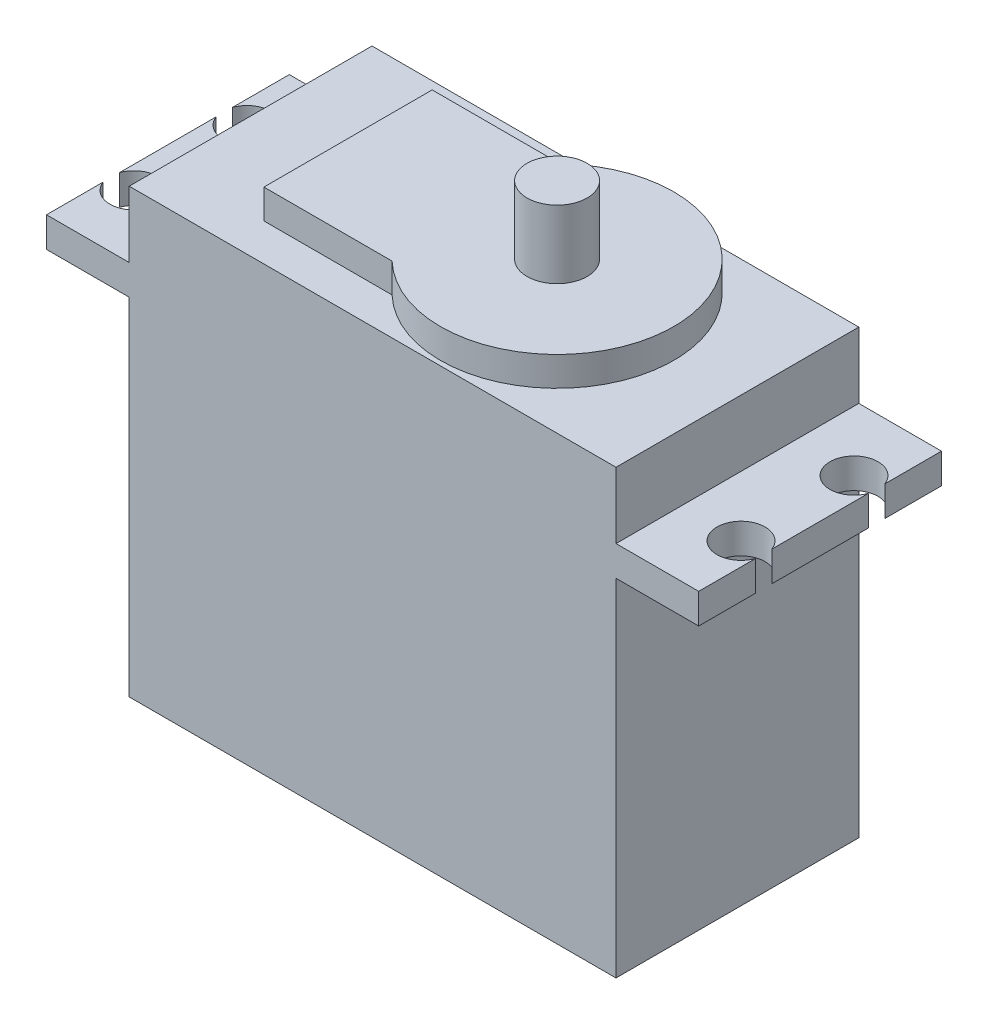
ISO-10303-21;
HEADER;
FILE_DESCRIPTION(('STEP AP214'),'2;1');
FILE_NAME('part.step','',(''),(''),'','','');
FILE_SCHEMA(('AUTOMOTIVE_DESIGN { 1 0 10303 214 1 1 1 1 }'));
ENDSEC;
DATA;
#1=APPLICATION_CONTEXT('core data for automotive mechanical design processes');
#2=APPLICATION_PROTOCOL_DEFINITION('international standard','automotive_design',2000,#1);
#3=PRODUCT_CONTEXT('',#1,'mechanical');
#4=PRODUCT('Part','Part','',(#3));
#5=PRODUCT_RELATED_PRODUCT_CATEGORY('part','',(#4));
#6=PRODUCT_DEFINITION_FORMATION('','',#4);
#7=PRODUCT_DEFINITION_CONTEXT('part definition',#1,'design');
#8=PRODUCT_DEFINITION('design','',#6,#7);
#9=PRODUCT_DEFINITION_SHAPE('','',#8);
#10=(LENGTH_UNIT() NAMED_UNIT(*) SI_UNIT(.MILLI.,.METRE.));
#11=(NAMED_UNIT(*) PLANE_ANGLE_UNIT() SI_UNIT($,.RADIAN.));
#12=(NAMED_UNIT(*) SI_UNIT($,.STERADIAN.) SOLID_ANGLE_UNIT());
#13=UNCERTAINTY_MEASURE_WITH_UNIT(LENGTH_MEASURE(1.E-05),#10,'distance_accuracy_value','');
#14=(GEOMETRIC_REPRESENTATION_CONTEXT(3) GLOBAL_UNCERTAINTY_ASSIGNED_CONTEXT((#13)) GLOBAL_UNIT_ASSIGNED_CONTEXT((#10,
#11,#12)) REPRESENTATION_CONTEXT('',''));
#15=CARTESIAN_POINT('',(0.,0.,0.));
#16=DIRECTION('',(0.,0.,1.));
#17=DIRECTION('',(1.,0.,0.));
#18=AXIS2_PLACEMENT_3D('',#15,#16,#17);
#19=CARTESIAN_POINT('',(-6.88,0.,0.));
#20=DIRECTION('',(-1.,0.,0.));
#21=DIRECTION('',(0.,0.,1.));
#22=AXIS2_PLACEMENT_3D('',#19,#20,#21);
#23=PLANE('',#22);
#24=DIRECTION('',(0.,1.,0.));
#25=VECTOR('',#24,1.);
#26=CARTESIAN_POINT('',(-6.88000000000001,0.,-14.1176511156307));
#27=LINE('',#26,#25);
#28=CARTESIAN_POINT('',(-6.88000000000001,28.8,-14.1176511156307));
#29=VERTEX_POINT('',#28);
#30=CARTESIAN_POINT('',(-6.88000000000001,31.3,-14.1176511156307));
#31=VERTEX_POINT('',#30);
#32=EDGE_CURVE('E11',#29,#31,#27,.T.);
#33=ORIENTED_EDGE('',*,*,#32,.F.);
#34=DIRECTION('',(0.,0.,1.));
#35=VECTOR('',#34,1.);
#36=CARTESIAN_POINT('',(-6.88000000000001,28.8,-20.2));
#37=LINE('',#36,#35);
#38=CARTESIAN_POINT('',(-6.88000000000001,28.8,-6.08234888436929));
#39=VERTEX_POINT('',#38);
#40=EDGE_CURVE('E329',#29,#39,#37,.T.);
#41=ORIENTED_EDGE('',*,*,#40,.T.);
#42=DIRECTION('',(0.,1.,0.));
#43=VECTOR('',#42,1.);
#44=CARTESIAN_POINT('',(-6.88000000000001,0.,-6.08234888436929));
#45=LINE('',#44,#43);
#46=CARTESIAN_POINT('',(-6.88,31.3,-6.08234888436929));
#47=VERTEX_POINT('',#46);
#48=EDGE_CURVE('E214',#47,#39,#45,.F.);
#49=ORIENTED_EDGE('',*,*,#48,.F.);
#50=DIRECTION('',(0.,0.,-1.));
#51=VECTOR('',#50,1.);
#52=CARTESIAN_POINT('',(-6.88000000000001,31.3,-20.2));
#53=LINE('',#52,#51);
#54=EDGE_CURVE('E209',#47,#31,#53,.T.);
#55=ORIENTED_EDGE('',*,*,#54,.T.);
#56=EDGE_LOOP('',(#33,#41,#49,#55));
#57=FACE_BOUND('',#56,.T.);
#58=ADVANCED_FACE('F40',(#57),#23,.T.);
#59=DIRECTION('',(0.,1.,0.));
#60=VECTOR('',#59,1.);
#61=CARTESIAN_POINT('',(-6.88,0.,-4.71765111563071));
#62=LINE('',#61,#60);
#63=CARTESIAN_POINT('',(-6.88,28.8,-4.71765111563071));
#64=VERTEX_POINT('',#63);
#65=CARTESIAN_POINT('',(-6.88,31.3,-4.71765111563071));
#66=VERTEX_POINT('',#65);
#67=EDGE_CURVE('E321',#64,#66,#62,.T.);
#68=ORIENTED_EDGE('',*,*,#67,.F.);
#69=CARTESIAN_POINT('',(-6.88,28.8,0.));
#70=VERTEX_POINT('',#69);
#71=EDGE_CURVE('E336',#64,#70,#37,.T.);
#72=ORIENTED_EDGE('',*,*,#71,.T.);
#73=DIRECTION('',(0.,1.,0.));
#74=VECTOR('',#73,1.);
#75=CARTESIAN_POINT('',(-6.88,31.3,0.));
#76=LINE('',#75,#74);
#77=CARTESIAN_POINT('',(-6.88,31.3,0.));
#78=VERTEX_POINT('',#77);
#79=EDGE_CURVE('E219',#70,#78,#76,.T.);
#80=ORIENTED_EDGE('',*,*,#79,.T.);
#81=EDGE_CURVE('E215',#78,#66,#53,.T.);
#82=ORIENTED_EDGE('',*,*,#81,.T.);
#83=EDGE_LOOP('',(#68,#72,#80,#82));
#84=FACE_BOUND('',#83,.T.);
#85=ADVANCED_FACE('F426',(#84),#23,.T.);
#86=CARTESIAN_POINT('',(47.38,0.,0.));
#87=DIRECTION('',(1.,0.,0.));
#88=DIRECTION('',(0.,0.,-1.));
#89=AXIS2_PLACEMENT_3D('',#86,#87,#88);
#90=PLANE('',#89);
#91=DIRECTION('',(0.,1.,0.));
#92=VECTOR('',#91,1.);
#93=CARTESIAN_POINT('',(47.38,0.,-6.08234888436926));
#94=LINE('',#93,#92);
#95=CARTESIAN_POINT('',(47.38,28.8,-6.08234888436925));
#96=VERTEX_POINT('',#95);
#97=CARTESIAN_POINT('',(47.38,31.3,-6.08234888436925));
#98=VERTEX_POINT('',#97);
#99=EDGE_CURVE('E318',#96,#98,#94,.T.);
#100=ORIENTED_EDGE('',*,*,#99,.F.);
#101=DIRECTION('',(0.,0.,-1.));
#102=VECTOR('',#101,1.);
#103=CARTESIAN_POINT('',(47.38,28.8,0.));
#104=LINE('',#103,#102);
#105=CARTESIAN_POINT('',(47.38,28.8,-14.1176511156307));
#106=VERTEX_POINT('',#105);
#107=EDGE_CURVE('E370',#96,#106,#104,.T.);
#108=ORIENTED_EDGE('',*,*,#107,.T.);
#109=DIRECTION('',(0.,1.,0.));
#110=VECTOR('',#109,1.);
#111=CARTESIAN_POINT('',(47.38,0.,-14.1176511156307));
#112=LINE('',#111,#110);
#113=CARTESIAN_POINT('',(47.38,31.3,-14.1176511156307));
#114=VERTEX_POINT('',#113);
#115=EDGE_CURVE('E249',#114,#106,#112,.F.);
#116=ORIENTED_EDGE('',*,*,#115,.F.);
#117=DIRECTION('',(0.,0.,1.));
#118=VECTOR('',#117,1.);
#119=CARTESIAN_POINT('',(47.38,31.3,0.));
#120=LINE('',#119,#118);
#121=EDGE_CURVE('E363',#114,#98,#120,.T.);
#122=ORIENTED_EDGE('',*,*,#121,.T.);
#123=EDGE_LOOP('',(#100,#108,#116,#122));
#124=FACE_BOUND('',#123,.T.);
#125=ADVANCED_FACE('F396',(#124),#90,.T.);
#126=DIRECTION('',(0.,1.,0.));
#127=VECTOR('',#126,1.);
#128=CARTESIAN_POINT('',(47.38,0.,-15.4823488843693));
#129=LINE('',#128,#127);
#130=CARTESIAN_POINT('',(47.38,28.8,-15.4823488843693));
#131=VERTEX_POINT('',#130);
#132=CARTESIAN_POINT('',(47.38,31.3,-15.4823488843693));
#133=VERTEX_POINT('',#132);
#134=EDGE_CURVE('E314',#131,#133,#129,.T.);
#135=ORIENTED_EDGE('',*,*,#134,.F.);
#136=CARTESIAN_POINT('',(47.38,28.8,-20.2));
#137=VERTEX_POINT('',#136);
#138=EDGE_CURVE('E371',#131,#137,#104,.T.);
#139=ORIENTED_EDGE('',*,*,#138,.T.);
#140=DIRECTION('',(0.,1.,0.));
#141=VECTOR('',#140,1.);
#142=CARTESIAN_POINT('',(47.38,31.3,-20.2));
#143=LINE('',#142,#141);
#144=CARTESIAN_POINT('',(47.38,31.3,-20.2));
#145=VERTEX_POINT('',#144);
#146=EDGE_CURVE('E365',#137,#145,#143,.T.);
#147=ORIENTED_EDGE('',*,*,#146,.T.);
#148=EDGE_CURVE('E354',#145,#133,#120,.T.);
#149=ORIENTED_EDGE('',*,*,#148,.T.);
#150=EDGE_LOOP('',(#135,#139,#147,#149));
#151=FACE_BOUND('',#150,.T.);
#152=ADVANCED_FACE('F487',(#151),#90,.T.);
#153=CARTESIAN_POINT('',(40.5,36.8,0.));
#154=DIRECTION('',(-1.,0.,0.));
#155=DIRECTION('',(0.,0.,1.));
#156=AXIS2_PLACEMENT_3D('',#153,#154,#155);
#157=PLANE('',#156);
#158=DIRECTION('',(0.,0.,1.));
#159=VECTOR('',#158,1.);
#160=CARTESIAN_POINT('',(40.5,31.3,0.));
#161=LINE('',#160,#159);
#162=CARTESIAN_POINT('',(40.5,31.3,-20.2));
#163=VERTEX_POINT('',#162);
#164=CARTESIAN_POINT('',(40.5,31.3,0.));
#165=VERTEX_POINT('',#164);
#166=EDGE_CURVE('E355',#163,#165,#161,.T.);
#167=ORIENTED_EDGE('',*,*,#166,.F.);
#168=DIRECTION('',(0.,-1.,0.));
#169=VECTOR('',#168,1.);
#170=CARTESIAN_POINT('',(40.5,36.8,-20.2));
#171=LINE('',#170,#169);
#172=CARTESIAN_POINT('',(40.5,36.8,-20.2));
#173=VERTEX_POINT('',#172);
#174=EDGE_CURVE('E304',#173,#163,#171,.T.);
#175=ORIENTED_EDGE('',*,*,#174,.F.);
#176=DIRECTION('',(0.,0.,-1.));
#177=VECTOR('',#176,1.);
#178=CARTESIAN_POINT('',(40.5,36.8,0.));
#179=LINE('',#178,#177);
#180=CARTESIAN_POINT('',(40.5,36.8,0.));
#181=VERTEX_POINT('',#180);
#182=EDGE_CURVE('E286',#181,#173,#179,.T.);
#183=ORIENTED_EDGE('',*,*,#182,.F.);
#184=DIRECTION('',(0.,-1.,0.));
#185=VECTOR('',#184,1.);
#186=CARTESIAN_POINT('',(40.5,36.8,0.));
#187=LINE('',#186,#185);
#188=EDGE_CURVE('E308',#181,#165,#187,.T.);
#189=ORIENTED_EDGE('',*,*,#188,.T.);
#190=EDGE_LOOP('',(#167,#175,#183,#189));
#191=FACE_BOUND('',#190,.T.);
#192=ADVANCED_FACE('F484',(#191),#157,.F.);
#193=DIRECTION('',(0.,0.,-1.));
#194=VECTOR('',#193,1.);
#195=CARTESIAN_POINT('',(40.5,28.8,0.));
#196=LINE('',#195,#194);
#197=CARTESIAN_POINT('',(40.5,28.8,0.));
#198=VERTEX_POINT('',#197);
#199=CARTESIAN_POINT('',(40.5,28.8,-20.2));
#200=VERTEX_POINT('',#199);
#201=EDGE_CURVE('E330',#198,#200,#196,.T.);
#202=ORIENTED_EDGE('',*,*,#201,.F.);
#203=CARTESIAN_POINT('',(40.5,0.,0.));
#204=VERTEX_POINT('',#203);
#205=EDGE_CURVE('E307',#198,#204,#187,.T.);
#206=ORIENTED_EDGE('',*,*,#205,.T.);
#207=DIRECTION('',(0.,0.,-1.));
#208=VECTOR('',#207,1.);
#209=CARTESIAN_POINT('',(40.5,0.,0.));
#210=LINE('',#209,#208);
#211=CARTESIAN_POINT('',(40.5,0.,-20.2));
#212=VERTEX_POINT('',#211);
#213=EDGE_CURVE('E296',#204,#212,#210,.T.);
#214=ORIENTED_EDGE('',*,*,#213,.T.);
#215=EDGE_CURVE('E303',#200,#212,#171,.T.);
#216=ORIENTED_EDGE('',*,*,#215,.F.);
#217=EDGE_LOOP('',(#202,#206,#214,#216));
#218=FACE_BOUND('',#217,.T.);
#219=ADVANCED_FACE('F486',(#218),#157,.F.);
#220=CARTESIAN_POINT('',(0.,36.8,0.));
#221=DIRECTION('',(1.,0.,0.));
#222=DIRECTION('',(0.,0.,-1.));
#223=AXIS2_PLACEMENT_3D('',#220,#221,#222);
#224=PLANE('',#223);
#225=DIRECTION('',(0.,0.,-1.));
#226=VECTOR('',#225,1.);
#227=CARTESIAN_POINT('',(0.,31.3,-20.2));
#228=LINE('',#227,#226);
#229=CARTESIAN_POINT('',(0.,31.3,0.));
#230=VERTEX_POINT('',#229);
#231=CARTESIAN_POINT('',(0.,31.3,-20.2));
#232=VERTEX_POINT('',#231);
#233=EDGE_CURVE('E226',#230,#232,#228,.T.);
#234=ORIENTED_EDGE('',*,*,#233,.F.);
#235=DIRECTION('',(0.,-1.,0.));
#236=VECTOR('',#235,1.);
#237=CARTESIAN_POINT('',(0.,36.8,0.));
#238=LINE('',#237,#236);
#239=CARTESIAN_POINT('',(0.,36.8,0.));
#240=VERTEX_POINT('',#239);
#241=EDGE_CURVE('E250',#240,#230,#238,.T.);
#242=ORIENTED_EDGE('',*,*,#241,.F.);
#243=DIRECTION('',(0.,0.,1.));
#244=VECTOR('',#243,1.);
#245=CARTESIAN_POINT('',(0.,36.8,0.));
#246=LINE('',#245,#244);
#247=CARTESIAN_POINT('',(0.,36.8,-20.2));
#248=VERTEX_POINT('',#247);
#249=EDGE_CURVE('E280',#248,#240,#246,.T.);
#250=ORIENTED_EDGE('',*,*,#249,.F.);
#251=DIRECTION('',(0.,-1.,0.));
#252=VECTOR('',#251,1.);
#253=CARTESIAN_POINT('',(0.,36.8,-20.2));
#254=LINE('',#253,#252);
#255=EDGE_CURVE('E301',#248,#232,#254,.T.);
#256=ORIENTED_EDGE('',*,*,#255,.T.);
#257=EDGE_LOOP('',(#234,#242,#250,#256));
#258=FACE_BOUND('',#257,.T.);
#259=ADVANCED_FACE('F42',(#258),#224,.F.);
#260=DIRECTION('',(0.,0.,1.));
#261=VECTOR('',#260,1.);
#262=CARTESIAN_POINT('',(0.,28.8,-20.2));
#263=LINE('',#262,#261);
#264=CARTESIAN_POINT('',(0.,28.8,-20.2));
#265=VERTEX_POINT('',#264);
#266=CARTESIAN_POINT('',(0.,28.8,0.));
#267=VERTEX_POINT('',#266);
#268=EDGE_CURVE('E223',#265,#267,#263,.T.);
#269=ORIENTED_EDGE('',*,*,#268,.F.);
#270=CARTESIAN_POINT('',(0.,0.,-20.2));
#271=VERTEX_POINT('',#270);
#272=EDGE_CURVE('E290',#265,#271,#254,.T.);
#273=ORIENTED_EDGE('',*,*,#272,.T.);
#274=DIRECTION('',(0.,0.,1.));
#275=VECTOR('',#274,1.);
#276=CARTESIAN_POINT('',(0.,0.,0.));
#277=LINE('',#276,#275);
#278=CARTESIAN_POINT('',(0.,0.,0.));
#279=VERTEX_POINT('',#278);
#280=EDGE_CURVE('E279',#271,#279,#277,.T.);
#281=ORIENTED_EDGE('',*,*,#280,.T.);
#282=EDGE_CURVE('E310',#267,#279,#238,.T.);
#283=ORIENTED_EDGE('',*,*,#282,.F.);
#284=EDGE_LOOP('',(#269,#273,#281,#283));
#285=FACE_BOUND('',#284,.T.);
#286=ADVANCED_FACE('F475',(#285),#224,.F.);
#287=CARTESIAN_POINT('',(0.,36.8,0.));
#288=DIRECTION('',(0.,-1.,0.));
#289=DIRECTION('',(0.,0.,-1.));
#290=AXIS2_PLACEMENT_3D('',#287,#288,#289);
#291=PLANE('',#290);
#292=ORIENTED_EDGE('',*,*,#249,.T.);
#293=DIRECTION('',(1.,0.,0.));
#294=VECTOR('',#293,1.);
#295=CARTESIAN_POINT('',(0.,36.8,0.));
#296=LINE('',#295,#294);
#297=EDGE_CURVE('E283',#240,#181,#296,.T.);
#298=ORIENTED_EDGE('',*,*,#297,.T.);
#299=ORIENTED_EDGE('',*,*,#182,.T.);
#300=DIRECTION('',(-1.,0.,0.));
#301=VECTOR('',#300,1.);
#302=CARTESIAN_POINT('',(0.,36.8,-20.2));
#303=LINE('',#302,#301);
#304=EDGE_CURVE('E288',#173,#248,#303,.T.);
#305=ORIENTED_EDGE('',*,*,#304,.T.);
#306=EDGE_LOOP('',(#292,#298,#299,#305));
#307=FACE_BOUND('',#306,.T.);
#308=CARTESIAN_POINT('',(25.5,36.8,-10.1));
#309=DIRECTION('',(0.,1.,0.));
#310=DIRECTION('',(0.,0.,1.));
#311=AXIS2_PLACEMENT_3D('',#308,#309,#310);
#312=CIRCLE('',#311,9.71033311812395);
#313=CARTESIAN_POINT('',(18.7701731623366,36.8,-3.1));
#314=VERTEX_POINT('',#313);
#315=CARTESIAN_POINT('',(18.7701731623366,36.8,-17.1));
#316=VERTEX_POINT('',#315);
#317=EDGE_CURVE('E245',#314,#316,#312,.T.);
#318=ORIENTED_EDGE('',*,*,#317,.F.);
#319=DIRECTION('',(1.,0.,0.));
#320=VECTOR('',#319,1.);
#321=CARTESIAN_POINT('',(0.,36.8,-3.1));
#322=LINE('',#321,#320);
#323=CARTESIAN_POINT('',(8.10646917607981,36.8,-3.1));
#324=VERTEX_POINT('',#323);
#325=EDGE_CURVE('E254',#324,#314,#322,.T.);
#326=ORIENTED_EDGE('',*,*,#325,.F.);
#327=DIRECTION('',(0.,0.,1.));
#328=VECTOR('',#327,1.);
#329=CARTESIAN_POINT('',(8.10646917607981,36.8,0.));
#330=LINE('',#329,#328);
#331=CARTESIAN_POINT('',(8.10646917607981,36.8,-17.1));
#332=VERTEX_POINT('',#331);
#333=EDGE_CURVE('E266',#332,#324,#330,.T.);
#334=ORIENTED_EDGE('',*,*,#333,.F.);
#335=DIRECTION('',(1.,0.,0.));
#336=VECTOR('',#335,1.);
#337=CARTESIAN_POINT('',(0.,36.8,-17.1));
#338=LINE('',#337,#336);
#339=EDGE_CURVE('E263',#332,#316,#338,.T.);
#340=ORIENTED_EDGE('',*,*,#339,.T.);
#341=EDGE_LOOP('',(#318,#326,#334,#340));
#342=FACE_BOUND('',#341,.T.);
#343=ADVANCED_FACE('F472',(#307,#342),#291,.F.);
#344=CARTESIAN_POINT('',(0.,36.8,0.));
#345=DIRECTION('',(0.,0.,-1.));
#346=DIRECTION('',(-1.,0.,0.));
#347=AXIS2_PLACEMENT_3D('',#344,#345,#346);
#348=PLANE('',#347);
#349=DIRECTION('',(1.,0.,0.));
#350=VECTOR('',#349,1.);
#351=CARTESIAN_POINT('',(0.,0.,0.));
#352=LINE('',#351,#350);
#353=EDGE_CURVE('E293',#279,#204,#352,.T.);
#354=ORIENTED_EDGE('',*,*,#353,.T.);
#355=ORIENTED_EDGE('',*,*,#205,.F.);
#356=DIRECTION('',(-1.,0.,0.));
#357=VECTOR('',#356,1.);
#358=CARTESIAN_POINT('',(47.38,28.8,0.));
#359=LINE('',#358,#357);
#360=CARTESIAN_POINT('',(47.38,28.8,0.));
#361=VERTEX_POINT('',#360);
#362=EDGE_CURVE('E227',#361,#198,#359,.T.);
#363=ORIENTED_EDGE('',*,*,#362,.F.);
#364=DIRECTION('',(0.,-1.,0.));
#365=VECTOR('',#364,1.);
#366=CARTESIAN_POINT('',(47.38,31.3,0.));
#367=LINE('',#366,#365);
#368=CARTESIAN_POINT('',(47.38,31.3,0.));
#369=VERTEX_POINT('',#368);
#370=EDGE_CURVE('E358',#369,#361,#367,.T.);
#371=ORIENTED_EDGE('',*,*,#370,.F.);
#372=DIRECTION('',(-1.,0.,0.));
#373=VECTOR('',#372,1.);
#374=CARTESIAN_POINT('',(47.38,31.3,0.));
#375=LINE('',#374,#373);
#376=EDGE_CURVE('E351',#369,#165,#375,.T.);
#377=ORIENTED_EDGE('',*,*,#376,.T.);
#378=ORIENTED_EDGE('',*,*,#188,.F.);
#379=ORIENTED_EDGE('',*,*,#297,.F.);
#380=ORIENTED_EDGE('',*,*,#241,.T.);
#381=DIRECTION('',(1.,0.,0.));
#382=VECTOR('',#381,1.);
#383=CARTESIAN_POINT('',(-6.88,31.3,0.));
#384=LINE('',#383,#382);
#385=EDGE_CURVE('E233',#78,#230,#384,.T.);
#386=ORIENTED_EDGE('',*,*,#385,.F.);
#387=ORIENTED_EDGE('',*,*,#79,.F.);
#388=DIRECTION('',(1.,0.,0.));
#389=VECTOR('',#388,1.);
#390=CARTESIAN_POINT('',(-6.88,28.8,0.));
#391=LINE('',#390,#389);
#392=EDGE_CURVE('E236',#70,#267,#391,.T.);
#393=ORIENTED_EDGE('',*,*,#392,.T.);
#394=ORIENTED_EDGE('',*,*,#282,.T.);
#395=EDGE_LOOP('',(#354,#355,#363,#371,#377,#378,#379,#380,#386,#387,#393,#394));
#396=FACE_BOUND('',#395,.T.);
#397=ADVANCED_FACE('F409',(#396),#348,.F.);
#398=CARTESIAN_POINT('',(0.,36.8,-20.2));
#399=DIRECTION('',(0.,0.,1.));
#400=DIRECTION('',(1.,0.,0.));
#401=AXIS2_PLACEMENT_3D('',#398,#399,#400);
#402=PLANE('',#401);
#403=DIRECTION('',(-1.,0.,0.));
#404=VECTOR('',#403,1.);
#405=CARTESIAN_POINT('',(0.,0.,-20.2));
#406=LINE('',#405,#404);
#407=EDGE_CURVE('E284',#212,#271,#406,.T.);
#408=ORIENTED_EDGE('',*,*,#407,.T.);
#409=ORIENTED_EDGE('',*,*,#272,.F.);
#410=DIRECTION('',(1.,0.,0.));
#411=VECTOR('',#410,1.);
#412=CARTESIAN_POINT('',(-6.88000000000001,28.8,-20.2));
#413=LINE('',#412,#411);
#414=CARTESIAN_POINT('',(-6.88000000000001,28.8,-20.2));
#415=VERTEX_POINT('',#414);
#416=EDGE_CURVE('E239',#415,#265,#413,.T.);
#417=ORIENTED_EDGE('',*,*,#416,.F.);
#418=DIRECTION('',(0.,-1.,0.));
#419=VECTOR('',#418,1.);
#420=CARTESIAN_POINT('',(-6.88000000000001,31.3,-20.2));
#421=LINE('',#420,#419);
#422=CARTESIAN_POINT('',(-6.88000000000001,31.3,-20.2));
#423=VERTEX_POINT('',#422);
#424=EDGE_CURVE('E230',#423,#415,#421,.T.);
#425=ORIENTED_EDGE('',*,*,#424,.F.);
#426=DIRECTION('',(1.,0.,0.));
#427=VECTOR('',#426,1.);
#428=CARTESIAN_POINT('',(-6.88000000000001,31.3,-20.2));
#429=LINE('',#428,#427);
#430=EDGE_CURVE('E218',#423,#232,#429,.T.);
#431=ORIENTED_EDGE('',*,*,#430,.T.);
#432=ORIENTED_EDGE('',*,*,#255,.F.);
#433=ORIENTED_EDGE('',*,*,#304,.F.);
#434=ORIENTED_EDGE('',*,*,#174,.T.);
#435=DIRECTION('',(-1.,0.,0.));
#436=VECTOR('',#435,1.);
#437=CARTESIAN_POINT('',(47.38,31.3,-20.2));
#438=LINE('',#437,#436);
#439=EDGE_CURVE('E348',#145,#163,#438,.T.);
#440=ORIENTED_EDGE('',*,*,#439,.F.);
#441=ORIENTED_EDGE('',*,*,#146,.F.);
#442=DIRECTION('',(-1.,0.,0.));
#443=VECTOR('',#442,1.);
#444=CARTESIAN_POINT('',(47.38,28.8,-20.2));
#445=LINE('',#444,#443);
#446=EDGE_CURVE('E345',#137,#200,#445,.T.);
#447=ORIENTED_EDGE('',*,*,#446,.T.);
#448=ORIENTED_EDGE('',*,*,#215,.T.);
#449=EDGE_LOOP('',(#408,#409,#417,#425,#431,#432,#433,#434,#440,#441,#447,#448));
#450=FACE_BOUND('',#449,.T.);
#451=ADVANCED_FACE('F479',(#450),#402,.F.);
#452=CARTESIAN_POINT('',(0.,0.,0.));
#453=DIRECTION('',(0.,-1.,0.));
#454=DIRECTION('',(0.,0.,-1.));
#455=AXIS2_PLACEMENT_3D('',#452,#453,#454);
#456=PLANE('',#455);
#457=ORIENTED_EDGE('',*,*,#280,.F.);
#458=ORIENTED_EDGE('',*,*,#407,.F.);
#459=ORIENTED_EDGE('',*,*,#213,.F.);
#460=ORIENTED_EDGE('',*,*,#353,.F.);
#461=EDGE_LOOP('',(#457,#458,#459,#460));
#462=FACE_BOUND('',#461,.T.);
#463=ADVANCED_FACE('F470',(#462),#456,.T.);
#464=CARTESIAN_POINT('',(25.5,39.24,-10.1));
#465=DIRECTION('',(0.,-1.,0.));
#466=DIRECTION('',(0.,0.,-1.));
#467=AXIS2_PLACEMENT_3D('',#464,#465,#466);
#468=CYLINDRICAL_SURFACE('',#467,9.71033311812395);
#469=ORIENTED_EDGE('',*,*,#317,.T.);
#470=DIRECTION('',(0.,-1.,0.));
#471=VECTOR('',#470,1.);
#472=CARTESIAN_POINT('',(18.7701731623366,39.24,-17.1));
#473=LINE('',#472,#471);
#474=CARTESIAN_POINT('',(18.7701731623366,39.24,-17.1));
#475=VERTEX_POINT('',#474);
#476=EDGE_CURVE('E276',#475,#316,#473,.T.);
#477=ORIENTED_EDGE('',*,*,#476,.F.);
#478=CARTESIAN_POINT('',(25.5,39.24,-10.1));
#479=DIRECTION('',(0.,1.,0.));
#480=DIRECTION('',(0.,0.,1.));
#481=AXIS2_PLACEMENT_3D('',#478,#479,#480);
#482=CIRCLE('',#481,9.71033311812395);
#483=CARTESIAN_POINT('',(18.7701731623366,39.24,-3.1));
#484=VERTEX_POINT('',#483);
#485=EDGE_CURVE('E251',#484,#475,#482,.T.);
#486=ORIENTED_EDGE('',*,*,#485,.F.);
#487=DIRECTION('',(0.,-1.,0.));
#488=VECTOR('',#487,1.);
#489=CARTESIAN_POINT('',(18.7701731623366,39.24,-3.1));
#490=LINE('',#489,#488);
#491=EDGE_CURVE('E261',#484,#314,#490,.T.);
#492=ORIENTED_EDGE('',*,*,#491,.T.);
#493=EDGE_LOOP('',(#469,#477,#486,#492));
#494=FACE_BOUND('',#493,.T.);
#495=ADVANCED_FACE('F466',(#494),#468,.T.);
#496=CARTESIAN_POINT('',(0.,39.24,-17.1));
#497=DIRECTION('',(0.,0.,-1.));
#498=DIRECTION('',(-1.,0.,0.));
#499=AXIS2_PLACEMENT_3D('',#496,#497,#498);
#500=PLANE('',#499);
#501=ORIENTED_EDGE('',*,*,#339,.F.);
#502=DIRECTION('',(0.,-1.,0.));
#503=VECTOR('',#502,1.);
#504=CARTESIAN_POINT('',(8.10646917607981,39.24,-17.1));
#505=LINE('',#504,#503);
#506=CARTESIAN_POINT('',(8.10646917607981,39.24,-17.1));
#507=VERTEX_POINT('',#506);
#508=EDGE_CURVE('E274',#507,#332,#505,.T.);
#509=ORIENTED_EDGE('',*,*,#508,.F.);
#510=DIRECTION('',(1.,0.,0.));
#511=VECTOR('',#510,1.);
#512=CARTESIAN_POINT('',(0.,39.24,-17.1));
#513=LINE('',#512,#511);
#514=EDGE_CURVE('E253',#507,#475,#513,.T.);
#515=ORIENTED_EDGE('',*,*,#514,.T.);
#516=ORIENTED_EDGE('',*,*,#476,.T.);
#517=EDGE_LOOP('',(#501,#509,#515,#516));
#518=FACE_BOUND('',#517,.T.);
#519=ADVANCED_FACE('F462',(#518),#500,.T.);
#520=CARTESIAN_POINT('',(8.10646917607981,39.24,0.));
#521=DIRECTION('',(1.,0.,0.));
#522=DIRECTION('',(0.,0.,-1.));
#523=AXIS2_PLACEMENT_3D('',#520,#521,#522);
#524=PLANE('',#523);
#525=ORIENTED_EDGE('',*,*,#333,.T.);
#526=DIRECTION('',(0.,-1.,0.));
#527=VECTOR('',#526,1.);
#528=CARTESIAN_POINT('',(8.10646917607981,39.24,-3.1));
#529=LINE('',#528,#527);
#530=CARTESIAN_POINT('',(8.10646917607981,39.24,-3.1));
#531=VERTEX_POINT('',#530);
#532=EDGE_CURVE('E271',#531,#324,#529,.T.);
#533=ORIENTED_EDGE('',*,*,#532,.F.);
#534=DIRECTION('',(0.,0.,1.));
#535=VECTOR('',#534,1.);
#536=CARTESIAN_POINT('',(8.10646917607981,39.24,0.));
#537=LINE('',#536,#535);
#538=EDGE_CURVE('E257',#507,#531,#537,.T.);
#539=ORIENTED_EDGE('',*,*,#538,.F.);
#540=ORIENTED_EDGE('',*,*,#508,.T.);
#541=EDGE_LOOP('',(#525,#533,#539,#540));
#542=FACE_BOUND('',#541,.T.);
#543=ADVANCED_FACE('F458',(#542),#524,.F.);
#544=CARTESIAN_POINT('',(0.,39.24,-3.1));
#545=DIRECTION('',(0.,0.,-1.));
#546=DIRECTION('',(-1.,0.,0.));
#547=AXIS2_PLACEMENT_3D('',#544,#545,#546);
#548=PLANE('',#547);
#549=ORIENTED_EDGE('',*,*,#325,.T.);
#550=ORIENTED_EDGE('',*,*,#491,.F.);
#551=DIRECTION('',(1.,0.,0.));
#552=VECTOR('',#551,1.);
#553=CARTESIAN_POINT('',(0.,39.24,-3.1));
#554=LINE('',#553,#552);
#555=EDGE_CURVE('E259',#531,#484,#554,.T.);
#556=ORIENTED_EDGE('',*,*,#555,.F.);
#557=ORIENTED_EDGE('',*,*,#532,.T.);
#558=EDGE_LOOP('',(#549,#550,#556,#557));
#559=FACE_BOUND('',#558,.T.);
#560=ADVANCED_FACE('F454',(#559),#548,.F.);
#561=CARTESIAN_POINT('',(0.,39.24,0.));
#562=DIRECTION('',(0.,1.,0.));
#563=DIRECTION('',(0.,0.,1.));
#564=AXIS2_PLACEMENT_3D('',#561,#562,#563);
#565=PLANE('',#564);
#566=CARTESIAN_POINT('',(25.5,39.24,-10.1));
#567=DIRECTION('',(0.,1.,0.));
#568=DIRECTION('',(0.,0.,1.));
#569=AXIS2_PLACEMENT_3D('',#566,#567,#568);
#570=CIRCLE('',#569,2.5);
#571=CARTESIAN_POINT('',(25.5,39.24,-7.6));
#572=VERTEX_POINT('',#571);
#573=EDGE_CURVE('E246',#572,#572,#570,.T.);
#574=ORIENTED_EDGE('',*,*,#573,.F.);
#575=EDGE_LOOP('',(#574));
#576=FACE_BOUND('',#575,.T.);
#577=ORIENTED_EDGE('',*,*,#485,.T.);
#578=ORIENTED_EDGE('',*,*,#514,.F.);
#579=ORIENTED_EDGE('',*,*,#538,.T.);
#580=ORIENTED_EDGE('',*,*,#555,.T.);
#581=EDGE_LOOP('',(#577,#578,#579,#580));
#582=FACE_BOUND('',#581,.T.);
#583=ADVANCED_FACE('F450',(#576,#582),#565,.T.);
#584=CARTESIAN_POINT('',(25.5,44.9,-10.1));
#585=DIRECTION('',(0.,-1.,0.));
#586=DIRECTION('',(0.,0.,-1.));
#587=AXIS2_PLACEMENT_3D('',#584,#585,#586);
#588=CYLINDRICAL_SURFACE('',#587,2.5);
#589=CARTESIAN_POINT('',(25.5,44.9,-10.1));
#590=DIRECTION('',(0.,1.,0.));
#591=DIRECTION('',(0.,0.,1.));
#592=AXIS2_PLACEMENT_3D('',#589,#590,#591);
#593=CIRCLE('',#592,2.5);
#594=CARTESIAN_POINT('',(25.5,44.9,-7.6));
#595=VERTEX_POINT('',#594);
#596=EDGE_CURVE('E242',#595,#595,#593,.T.);
#597=ORIENTED_EDGE('',*,*,#596,.F.);
#598=EDGE_LOOP('',(#597));
#599=FACE_BOUND('',#598,.T.);
#600=ORIENTED_EDGE('',*,*,#573,.T.);
#601=EDGE_LOOP('',(#600));
#602=FACE_BOUND('',#601,.T.);
#603=ADVANCED_FACE('F446',(#599,#602),#588,.T.);
#604=CARTESIAN_POINT('',(25.5,44.9,-10.1));
#605=DIRECTION('',(0.,1.,0.));
#606=DIRECTION('',(0.,0.,1.));
#607=AXIS2_PLACEMENT_3D('',#604,#605,#606);
#608=PLANE('',#607);
#609=ORIENTED_EDGE('',*,*,#596,.T.);
#610=EDGE_LOOP('',(#609));
#611=FACE_BOUND('',#610,.T.);
#612=ADVANCED_FACE('F441',(#611),#608,.T.);
#613=CARTESIAN_POINT('',(-6.88000000000001,28.8,-20.2));
#614=DIRECTION('',(0.,1.,0.));
#615=DIRECTION('',(0.,0.,1.));
#616=AXIS2_PLACEMENT_3D('',#613,#614,#615);
#617=PLANE('',#616);
#618=ORIENTED_EDGE('',*,*,#40,.F.);
#619=CARTESIAN_POINT('',(-5.00000000000001,28.8,-14.8));
#620=DIRECTION('',(0.,1.,0.));
#621=DIRECTION('',(0.,0.,1.));
#622=AXIS2_PLACEMENT_3D('',#619,#620,#621);
#623=CIRCLE('',#622,2.);
#624=CARTESIAN_POINT('',(-6.88000000000001,28.8,-15.4823488843693));
#625=VERTEX_POINT('',#624);
#626=EDGE_CURVE('E200',#29,#625,#623,.T.);
#627=ORIENTED_EDGE('',*,*,#626,.T.);
#628=EDGE_CURVE('E326',#415,#625,#37,.T.);
#629=ORIENTED_EDGE('',*,*,#628,.F.);
#630=ORIENTED_EDGE('',*,*,#416,.T.);
#631=ORIENTED_EDGE('',*,*,#268,.T.);
#632=ORIENTED_EDGE('',*,*,#392,.F.);
#633=ORIENTED_EDGE('',*,*,#71,.F.);
#634=CARTESIAN_POINT('',(-5.00000000000001,28.8,-5.4));
#635=DIRECTION('',(0.,1.,0.));
#636=DIRECTION('',(0.,0.,1.));
#637=AXIS2_PLACEMENT_3D('',#634,#635,#636);
#638=CIRCLE('',#637,2.);
#639=EDGE_CURVE('E331',#64,#39,#638,.T.);
#640=ORIENTED_EDGE('',*,*,#639,.T.);
#641=EDGE_LOOP('',(#618,#627,#629,#630,#631,#632,#633,#640));
#642=FACE_BOUND('',#641,.T.);
#643=ADVANCED_FACE('F325',(#642),#617,.F.);
#644=CARTESIAN_POINT('',(-6.88000000000001,31.3,-20.2));
#645=DIRECTION('',(0.,-1.,0.));
#646=DIRECTION('',(0.,0.,-1.));
#647=AXIS2_PLACEMENT_3D('',#644,#645,#646);
#648=PLANE('',#647);
#649=CARTESIAN_POINT('',(-6.88000000000001,31.3,-15.4823488843693));
#650=VERTEX_POINT('',#649);
#651=EDGE_CURVE('E211',#650,#423,#53,.T.);
#652=ORIENTED_EDGE('',*,*,#651,.F.);
#653=CARTESIAN_POINT('',(-5.00000000000001,31.3,-14.8));
#654=DIRECTION('',(0.,1.,0.));
#655=DIRECTION('',(0.,0.,1.));
#656=AXIS2_PLACEMENT_3D('',#653,#654,#655);
#657=CIRCLE('',#656,2.);
#658=EDGE_CURVE('E54',#31,#650,#657,.T.);
#659=ORIENTED_EDGE('',*,*,#658,.F.);
#660=ORIENTED_EDGE('',*,*,#54,.F.);
#661=CARTESIAN_POINT('',(-5.00000000000001,31.3,-5.4));
#662=DIRECTION('',(0.,1.,0.));
#663=DIRECTION('',(0.,0.,1.));
#664=AXIS2_PLACEMENT_3D('',#661,#662,#663);
#665=CIRCLE('',#664,2.);
#666=EDGE_CURVE('E62',#66,#47,#665,.T.);
#667=ORIENTED_EDGE('',*,*,#666,.F.);
#668=ORIENTED_EDGE('',*,*,#81,.F.);
#669=ORIENTED_EDGE('',*,*,#385,.T.);
#670=ORIENTED_EDGE('',*,*,#233,.T.);
#671=ORIENTED_EDGE('',*,*,#430,.F.);
#672=EDGE_LOOP('',(#652,#659,#660,#667,#668,#669,#670,#671));
#673=FACE_BOUND('',#672,.T.);
#674=ADVANCED_FACE('F208',(#673),#648,.F.);
#675=DIRECTION('',(0.,1.,0.));
#676=VECTOR('',#675,1.);
#677=CARTESIAN_POINT('',(-6.88000000000001,0.,-15.4823488843693));
#678=LINE('',#677,#676);
#679=EDGE_CURVE('E48',#650,#625,#678,.F.);
#680=ORIENTED_EDGE('',*,*,#679,.F.);
#681=ORIENTED_EDGE('',*,*,#651,.T.);
#682=ORIENTED_EDGE('',*,*,#424,.T.);
#683=ORIENTED_EDGE('',*,*,#628,.T.);
#684=EDGE_LOOP('',(#680,#681,#682,#683));
#685=FACE_BOUND('',#684,.T.);
#686=ADVANCED_FACE('F333',(#685),#23,.T.);
#687=CARTESIAN_POINT('',(47.38,28.8,0.));
#688=DIRECTION('',(0.,1.,0.));
#689=DIRECTION('',(0.,0.,1.));
#690=AXIS2_PLACEMENT_3D('',#687,#688,#689);
#691=PLANE('',#690);
#692=ORIENTED_EDGE('',*,*,#107,.F.);
#693=CARTESIAN_POINT('',(45.5,28.8,-5.4));
#694=DIRECTION('',(0.,1.,0.));
#695=DIRECTION('',(0.,0.,1.));
#696=AXIS2_PLACEMENT_3D('',#693,#694,#695);
#697=CIRCLE('',#696,2.);
#698=CARTESIAN_POINT('',(47.38,28.8,-4.71765111563076));
#699=VERTEX_POINT('',#698);
#700=EDGE_CURVE('E375',#96,#699,#697,.T.);
#701=ORIENTED_EDGE('',*,*,#700,.T.);
#702=EDGE_CURVE('E367',#361,#699,#104,.T.);
#703=ORIENTED_EDGE('',*,*,#702,.F.);
#704=ORIENTED_EDGE('',*,*,#362,.T.);
#705=ORIENTED_EDGE('',*,*,#201,.T.);
#706=ORIENTED_EDGE('',*,*,#446,.F.);
#707=ORIENTED_EDGE('',*,*,#138,.F.);
#708=CARTESIAN_POINT('',(45.5,28.8,-14.8));
#709=DIRECTION('',(0.,1.,0.));
#710=DIRECTION('',(0.,0.,1.));
#711=AXIS2_PLACEMENT_3D('',#708,#709,#710);
#712=CIRCLE('',#711,2.);
#713=EDGE_CURVE('E378',#131,#106,#712,.T.);
#714=ORIENTED_EDGE('',*,*,#713,.T.);
#715=EDGE_LOOP('',(#692,#701,#703,#704,#705,#706,#707,#714));
#716=FACE_BOUND('',#715,.T.);
#717=ADVANCED_FACE('F412',(#716),#691,.F.);
#718=CARTESIAN_POINT('',(47.38,31.3,0.));
#719=DIRECTION('',(0.,-1.,0.));
#720=DIRECTION('',(0.,0.,-1.));
#721=AXIS2_PLACEMENT_3D('',#718,#719,#720);
#722=PLANE('',#721);
#723=CARTESIAN_POINT('',(47.38,31.3,-4.71765111563076));
#724=VERTEX_POINT('',#723);
#725=EDGE_CURVE('E364',#724,#369,#120,.T.);
#726=ORIENTED_EDGE('',*,*,#725,.F.);
#727=CARTESIAN_POINT('',(45.5,31.3,-5.4));
#728=DIRECTION('',(0.,1.,0.));
#729=DIRECTION('',(0.,0.,1.));
#730=AXIS2_PLACEMENT_3D('',#727,#728,#729);
#731=CIRCLE('',#730,2.);
#732=EDGE_CURVE('E382',#98,#724,#731,.T.);
#733=ORIENTED_EDGE('',*,*,#732,.F.);
#734=ORIENTED_EDGE('',*,*,#121,.F.);
#735=CARTESIAN_POINT('',(45.5,31.3,-14.8));
#736=DIRECTION('',(0.,1.,0.));
#737=DIRECTION('',(0.,0.,1.));
#738=AXIS2_PLACEMENT_3D('',#735,#736,#737);
#739=CIRCLE('',#738,2.);
#740=EDGE_CURVE('E212',#133,#114,#739,.T.);
#741=ORIENTED_EDGE('',*,*,#740,.F.);
#742=ORIENTED_EDGE('',*,*,#148,.F.);
#743=ORIENTED_EDGE('',*,*,#439,.T.);
#744=ORIENTED_EDGE('',*,*,#166,.T.);
#745=ORIENTED_EDGE('',*,*,#376,.F.);
#746=EDGE_LOOP('',(#726,#733,#734,#741,#742,#743,#744,#745));
#747=FACE_BOUND('',#746,.T.);
#748=ADVANCED_FACE('F400',(#747),#722,.F.);
#749=DIRECTION('',(0.,1.,0.));
#750=VECTOR('',#749,1.);
#751=CARTESIAN_POINT('',(47.38,0.,-4.71765111563075));
#752=LINE('',#751,#750);
#753=EDGE_CURVE('E316',#724,#699,#752,.F.);
#754=ORIENTED_EDGE('',*,*,#753,.F.);
#755=ORIENTED_EDGE('',*,*,#725,.T.);
#756=ORIENTED_EDGE('',*,*,#370,.T.);
#757=ORIENTED_EDGE('',*,*,#702,.T.);
#758=EDGE_LOOP('',(#754,#755,#756,#757));
#759=FACE_BOUND('',#758,.T.);
#760=ADVANCED_FACE('F404',(#759),#90,.T.);
#761=CARTESIAN_POINT('',(45.5,0.,-14.8));
#762=DIRECTION('',(0.,1.,0.));
#763=DIRECTION('',(0.,0.,1.));
#764=AXIS2_PLACEMENT_3D('',#761,#762,#763);
#765=CYLINDRICAL_SURFACE('',#764,2.);
#766=ORIENTED_EDGE('',*,*,#134,.T.);
#767=ORIENTED_EDGE('',*,*,#740,.T.);
#768=ORIENTED_EDGE('',*,*,#115,.T.);
#769=ORIENTED_EDGE('',*,*,#713,.F.);
#770=EDGE_LOOP('',(#766,#767,#768,#769));
#771=FACE_BOUND('',#770,.T.);
#772=ADVANCED_FACE('F387',(#771),#765,.F.);
#773=CARTESIAN_POINT('',(45.5,0.,-5.4));
#774=DIRECTION('',(0.,1.,0.));
#775=DIRECTION('',(0.,0.,1.));
#776=AXIS2_PLACEMENT_3D('',#773,#774,#775);
#777=CYLINDRICAL_SURFACE('',#776,2.);
#778=ORIENTED_EDGE('',*,*,#99,.T.);
#779=ORIENTED_EDGE('',*,*,#732,.T.);
#780=ORIENTED_EDGE('',*,*,#753,.T.);
#781=ORIENTED_EDGE('',*,*,#700,.F.);
#782=EDGE_LOOP('',(#778,#779,#780,#781));
#783=FACE_BOUND('',#782,.T.);
#784=ADVANCED_FACE('F415',(#783),#777,.F.);
#785=CARTESIAN_POINT('',(-5.00000000000001,0.,-5.4));
#786=DIRECTION('',(0.,1.,0.));
#787=DIRECTION('',(0.,0.,1.));
#788=AXIS2_PLACEMENT_3D('',#785,#786,#787);
#789=CYLINDRICAL_SURFACE('',#788,2.);
#790=ORIENTED_EDGE('',*,*,#67,.T.);
#791=ORIENTED_EDGE('',*,*,#666,.T.);
#792=ORIENTED_EDGE('',*,*,#48,.T.);
#793=ORIENTED_EDGE('',*,*,#639,.F.);
#794=EDGE_LOOP('',(#790,#791,#792,#793));
#795=FACE_BOUND('',#794,.T.);
#796=ADVANCED_FACE('F417',(#795),#789,.F.);
#797=CARTESIAN_POINT('',(-5.00000000000001,0.,-14.8));
#798=DIRECTION('',(0.,1.,0.));
#799=DIRECTION('',(0.,0.,1.));
#800=AXIS2_PLACEMENT_3D('',#797,#798,#799);
#801=CYLINDRICAL_SURFACE('',#800,2.);
#802=ORIENTED_EDGE('',*,*,#32,.T.);
#803=ORIENTED_EDGE('',*,*,#658,.T.);
#804=ORIENTED_EDGE('',*,*,#679,.T.);
#805=ORIENTED_EDGE('',*,*,#626,.F.);
#806=EDGE_LOOP('',(#802,#803,#804,#805));
#807=FACE_BOUND('',#806,.T.);
#808=ADVANCED_FACE('F198',(#807),#801,.F.);
#809=CLOSED_SHELL('',(#58,#85,#125,#152,#192,#219,#259,#286,#343,#397,#451,#463,#495,#519,#543,
#560,#583,#603,#612,#643,#674,#686,#717,#748,#760,#772,#784,#796,#808));
#810=MANIFOLD_SOLID_BREP('B2',#809);
#811=ADVANCED_BREP_SHAPE_REPRESENTATION('',(#18,#810),#14);
#812=SHAPE_DEFINITION_REPRESENTATION(#9,#811);
ENDSEC;
END-ISO-10303-21;
